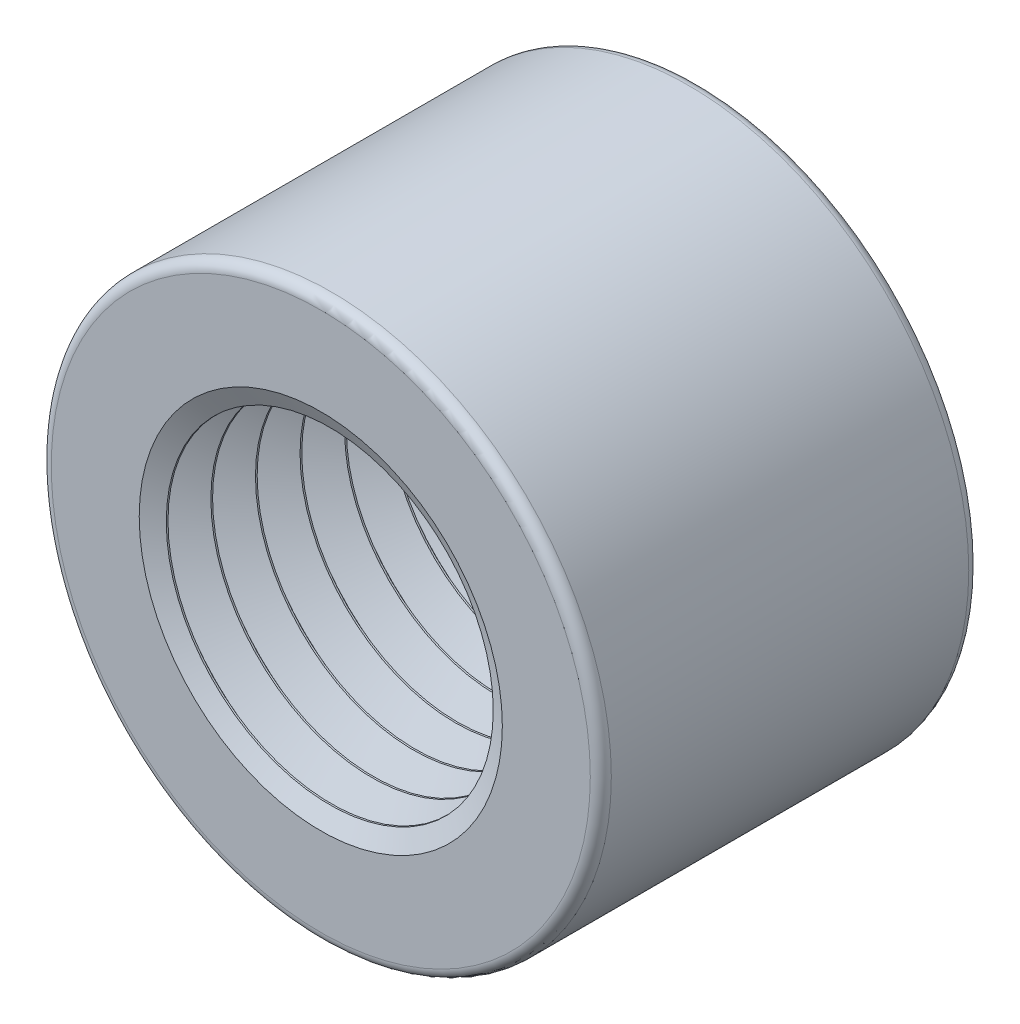
ISO-10303-21;
HEADER;
FILE_DESCRIPTION(('STEP AP214'),'2;1');
FILE_NAME('part.step','',(''),(''),'','','');
FILE_SCHEMA(('AUTOMOTIVE_DESIGN { 1 0 10303 214 1 1 1 1 }'));
ENDSEC;
DATA;
#1=APPLICATION_CONTEXT('core data for automotive mechanical design processes');
#2=APPLICATION_PROTOCOL_DEFINITION('international standard','automotive_design',2000,#1);
#3=PRODUCT_CONTEXT('',#1,'mechanical');
#4=PRODUCT('Part','Part','',(#3));
#5=PRODUCT_RELATED_PRODUCT_CATEGORY('part','',(#4));
#6=PRODUCT_DEFINITION_FORMATION('','',#4);
#7=PRODUCT_DEFINITION_CONTEXT('part definition',#1,'design');
#8=PRODUCT_DEFINITION('design','',#6,#7);
#9=PRODUCT_DEFINITION_SHAPE('','',#8);
#10=(LENGTH_UNIT() NAMED_UNIT(*) SI_UNIT(.MILLI.,.METRE.));
#11=(NAMED_UNIT(*) PLANE_ANGLE_UNIT() SI_UNIT($,.RADIAN.));
#12=(NAMED_UNIT(*) SI_UNIT($,.STERADIAN.) SOLID_ANGLE_UNIT());
#13=UNCERTAINTY_MEASURE_WITH_UNIT(LENGTH_MEASURE(1.E-05),#10,'distance_accuracy_value','');
#14=(GEOMETRIC_REPRESENTATION_CONTEXT(3) GLOBAL_UNCERTAINTY_ASSIGNED_CONTEXT((#13)) GLOBAL_UNIT_ASSIGNED_CONTEXT((#10,
#11,#12)) REPRESENTATION_CONTEXT('',''));
#15=CARTESIAN_POINT('',(0.,0.,0.));
#16=DIRECTION('',(0.,0.,1.));
#17=DIRECTION('',(1.,0.,0.));
#18=AXIS2_PLACEMENT_3D('',#15,#16,#17);
#19=CARTESIAN_POINT('',(0.,0.,6.35));
#20=DIRECTION('',(0.,0.,1.));
#21=DIRECTION('',(1.,0.,0.));
#22=AXIS2_PLACEMENT_3D('',#19,#20,#21);
#23=PLANE('',#22);
#24=CARTESIAN_POINT('',(0.,0.,6.35));
#25=DIRECTION('',(0.,0.,1.));
#26=DIRECTION('',(1.,0.,0.));
#27=AXIS2_PLACEMENT_3D('',#24,#25,#26);
#28=CIRCLE('',#27,6.0930204962207);
#29=CARTESIAN_POINT('',(6.0930204962207,0.,6.35));
#30=VERTEX_POINT('',#29);
#31=EDGE_CURVE('E37',#30,#30,#28,.T.);
#32=ORIENTED_EDGE('',*,*,#31,.F.);
#33=EDGE_LOOP('',(#32));
#34=FACE_BOUND('',#33,.T.);
#35=CARTESIAN_POINT('',(0.,0.,6.35));
#36=DIRECTION('',(0.,0.,1.));
#37=DIRECTION('',(1.,0.,0.));
#38=AXIS2_PLACEMENT_3D('',#35,#36,#37);
#39=CIRCLE('',#38,9.04522222222222);
#40=CARTESIAN_POINT('',(9.04522222222222,0.,6.35));
#41=VERTEX_POINT('',#40);
#42=EDGE_CURVE('E11',#41,#41,#39,.T.);
#43=ORIENTED_EDGE('',*,*,#42,.T.);
#44=EDGE_LOOP('',(#43));
#45=FACE_BOUND('',#44,.T.);
#46=ADVANCED_FACE('F33',(#34,#45),#23,.T.);
#47=CARTESIAN_POINT('',(0.,0.,-6.35));
#48=DIRECTION('',(0.,0.,1.));
#49=DIRECTION('',(1.,0.,0.));
#50=AXIS2_PLACEMENT_3D('',#47,#48,#49);
#51=PLANE('',#50);
#52=CARTESIAN_POINT('',(0.,0.,-6.35));
#53=DIRECTION('',(0.,0.,1.));
#54=DIRECTION('',(1.,0.,0.));
#55=AXIS2_PLACEMENT_3D('',#52,#53,#54);
#56=CIRCLE('',#55,9.04522222222222);
#57=CARTESIAN_POINT('',(9.04522222222222,0.,-6.35));
#58=VERTEX_POINT('',#57);
#59=EDGE_CURVE('E41',#58,#58,#56,.F.);
#60=ORIENTED_EDGE('',*,*,#59,.T.);
#61=EDGE_LOOP('',(#60));
#62=FACE_BOUND('',#61,.T.);
#63=CARTESIAN_POINT('',(0.,0.,-6.35));
#64=DIRECTION('',(0.,0.,1.));
#65=DIRECTION('',(1.,0.,0.));
#66=AXIS2_PLACEMENT_3D('',#63,#64,#65);
#67=CIRCLE('',#66,4.86939938663337);
#68=CARTESIAN_POINT('',(4.86939938663337,0.,-6.35));
#69=VERTEX_POINT('',#68);
#70=EDGE_CURVE('E53',#69,#69,#67,.T.);
#71=ORIENTED_EDGE('',*,*,#70,.T.);
#72=EDGE_LOOP('',(#71));
#73=FACE_BOUND('',#72,.T.);
#74=ADVANCED_FACE('F154',(#62,#73),#51,.F.);
#75=CARTESIAN_POINT('',(0.,0.,6.35));
#76=DIRECTION('',(0.,0.,-1.));
#77=DIRECTION('',(-1.,0.,0.));
#78=AXIS2_PLACEMENT_3D('',#75,#76,#77);
#79=CYLINDRICAL_SURFACE('',#78,9.398);
#80=CARTESIAN_POINT('',(0.,0.,-5.99722222222222));
#81=DIRECTION('',(0.,0.,1.));
#82=DIRECTION('',(1.,0.,0.));
#83=AXIS2_PLACEMENT_3D('',#80,#81,#82);
#84=CIRCLE('',#83,9.398);
#85=CARTESIAN_POINT('',(9.398,0.,-5.99722222222222));
#86=VERTEX_POINT('',#85);
#87=EDGE_CURVE('E45',#86,#86,#84,.T.);
#88=ORIENTED_EDGE('',*,*,#87,.T.);
#89=EDGE_LOOP('',(#88));
#90=FACE_BOUND('',#89,.T.);
#91=CARTESIAN_POINT('',(0.,0.,5.99722222222222));
#92=DIRECTION('',(0.,0.,1.));
#93=DIRECTION('',(1.,0.,0.));
#94=AXIS2_PLACEMENT_3D('',#91,#92,#93);
#95=CIRCLE('',#94,9.398);
#96=CARTESIAN_POINT('',(9.398,0.,5.99722222222222));
#97=VERTEX_POINT('',#96);
#98=EDGE_CURVE('E50',#97,#97,#95,.F.);
#99=ORIENTED_EDGE('',*,*,#98,.T.);
#100=EDGE_LOOP('',(#99));
#101=FACE_BOUND('',#100,.T.);
#102=ADVANCED_FACE('F150',(#90,#101),#79,.T.);
#103=CARTESIAN_POINT('',(0.,0.,0.));
#104=DIRECTION('',(0.,0.,1.));
#105=DIRECTION('',(1.,0.,0.));
#106=AXIS2_PLACEMENT_3D('',#103,#104,#105);
#107=CYLINDRICAL_SURFACE('',#106,4.86939938663337);
#108=CARTESIAN_POINT('',(0.,0.,-3.81000000000002));
#109=DIRECTION('',(0.,0.,-1.));
#110=DIRECTION('',(-1.,0.,0.));
#111=AXIS2_PLACEMENT_3D('',#108,#109,#110);
#112=CIRCLE('',#111,4.86939938663337);
#113=CARTESIAN_POINT('',(-4.86939938663337,0.,-3.81000000000002));
#114=VERTEX_POINT('',#113);
#115=EDGE_CURVE('E140',#114,#114,#112,.T.);
#116=ORIENTED_EDGE('',*,*,#115,.F.);
#117=EDGE_LOOP('',(#116));
#118=FACE_BOUND('',#117,.T.);
#119=ORIENTED_EDGE('',*,*,#70,.F.);
#120=EDGE_LOOP('',(#119));
#121=FACE_BOUND('',#120,.T.);
#122=ADVANCED_FACE('F146',(#118,#121),#107,.F.);
#123=CARTESIAN_POINT('',(0.,0.,-5.99722222222222));
#124=DIRECTION('',(0.,0.,1.));
#125=DIRECTION('',(1.,0.,0.));
#126=AXIS2_PLACEMENT_3D('',#123,#124,#125);
#127=TOROIDAL_SURFACE('',#126,9.04522222222222,0.352777777777778);
#128=ORIENTED_EDGE('',*,*,#59,.F.);
#129=EDGE_LOOP('',(#128));
#130=FACE_BOUND('',#129,.T.);
#131=ORIENTED_EDGE('',*,*,#87,.F.);
#132=EDGE_LOOP('',(#131));
#133=FACE_BOUND('',#132,.T.);
#134=ADVANCED_FACE('F149',(#130,#133),#127,.T.);
#135=CARTESIAN_POINT('',(0.,0.,5.99722222222222));
#136=DIRECTION('',(0.,0.,1.));
#137=DIRECTION('',(1.,0.,0.));
#138=AXIS2_PLACEMENT_3D('',#135,#136,#137);
#139=TOROIDAL_SURFACE('',#138,9.04522222222222,0.352777777777778);
#140=ORIENTED_EDGE('',*,*,#98,.F.);
#141=EDGE_LOOP('',(#140));
#142=FACE_BOUND('',#141,.T.);
#143=ORIENTED_EDGE('',*,*,#42,.F.);
#144=EDGE_LOOP('',(#143));
#145=FACE_BOUND('',#144,.T.);
#146=ADVANCED_FACE('F35',(#142,#145),#139,.T.);
#147=CARTESIAN_POINT('',(0.,0.,6.04850214048261));
#148=DIRECTION('',(0.,0.,1.));
#149=DIRECTION('',(1.,0.,0.));
#150=AXIS2_PLACEMENT_3D('',#147,#148,#149);
#151=CONICAL_SURFACE('',#150,5.4861889563086,1.10968033841801);
#152=ORIENTED_EDGE('',*,*,#31,.T.);
#153=EDGE_LOOP('',(#152));
#154=FACE_BOUND('',#153,.T.);
#155=CARTESIAN_POINT('',(0.,0.,6.04850214048261));
#156=DIRECTION('',(0.,0.,-1.));
#157=DIRECTION('',(-1.,0.,0.));
#158=AXIS2_PLACEMENT_3D('',#155,#156,#157);
#159=CIRCLE('',#158,5.4861889563086);
#160=CARTESIAN_POINT('',(-5.4861889563086,0.,6.04850214048261));
#161=VERTEX_POINT('',#160);
#162=EDGE_CURVE('E56',#161,#161,#159,.T.);
#163=ORIENTED_EDGE('',*,*,#162,.T.);
#164=EDGE_LOOP('',(#163));
#165=FACE_BOUND('',#164,.T.);
#166=ADVANCED_FACE('F171',(#154,#165),#151,.F.);
#167=CARTESIAN_POINT('',(0.,0.,5.9948158578326));
#168=DIRECTION('',(0.,0.,1.));
#169=DIRECTION('',(1.,0.,0.));
#170=AXIS2_PLACEMENT_3D('',#167,#168,#169);
#171=CONICAL_SURFACE('',#170,5.48283011551298,0.0624827872213823);
#172=ORIENTED_EDGE('',*,*,#162,.F.);
#173=EDGE_LOOP('',(#172));
#174=FACE_BOUND('',#173,.T.);
#175=CARTESIAN_POINT('',(0.,0.,5.9948158578326));
#176=DIRECTION('',(0.,0.,-1.));
#177=DIRECTION('',(-1.,0.,0.));
#178=AXIS2_PLACEMENT_3D('',#175,#176,#177);
#179=CIRCLE('',#178,5.48283011551298);
#180=CARTESIAN_POINT('',(-5.48283011551298,0.,5.9948158578326));
#181=VERTEX_POINT('',#180);
#182=EDGE_CURVE('E59',#181,#181,#179,.T.);
#183=ORIENTED_EDGE('',*,*,#182,.T.);
#184=EDGE_LOOP('',(#183));
#185=FACE_BOUND('',#184,.T.);
#186=ADVANCED_FACE('F182',(#174,#185),#171,.F.);
#187=CARTESIAN_POINT('',(0.,0.,5.2738331796281));
#188=DIRECTION('',(0.,0.,-1.));
#189=DIRECTION('',(-1.,0.,0.));
#190=AXIS2_PLACEMENT_3D('',#187,#188,#189);
#191=CONICAL_SURFACE('',#190,6.56881851738696,0.984714763975207);
#192=ORIENTED_EDGE('',*,*,#182,.F.);
#193=EDGE_LOOP('',(#192));
#194=FACE_BOUND('',#193,.T.);
#195=CARTESIAN_POINT('',(0.,0.,5.2738331796281));
#196=DIRECTION('',(0.,0.,-1.));
#197=DIRECTION('',(-1.,0.,0.));
#198=AXIS2_PLACEMENT_3D('',#195,#196,#197);
#199=CIRCLE('',#198,6.56881851738696);
#200=CARTESIAN_POINT('',(-6.56881851738696,0.,5.2738331796281));
#201=VERTEX_POINT('',#200);
#202=EDGE_CURVE('E62',#201,#201,#199,.T.);
#203=ORIENTED_EDGE('',*,*,#202,.T.);
#204=EDGE_LOOP('',(#203));
#205=FACE_BOUND('',#204,.T.);
#206=ADVANCED_FACE('F188',(#194,#205),#191,.F.);
#207=CARTESIAN_POINT('',(0.,0.,5.22014689697808));
#208=DIRECTION('',(0.,0.,1.));
#209=DIRECTION('',(1.,0.,0.));
#210=AXIS2_PLACEMENT_3D('',#207,#208,#209);
#211=CONICAL_SURFACE('',#210,6.56545967659134,0.0624827872213823);
#212=ORIENTED_EDGE('',*,*,#202,.F.);
#213=EDGE_LOOP('',(#212));
#214=FACE_BOUND('',#213,.T.);
#215=CARTESIAN_POINT('',(0.,0.,5.22014689697808));
#216=DIRECTION('',(0.,0.,-1.));
#217=DIRECTION('',(-1.,0.,0.));
#218=AXIS2_PLACEMENT_3D('',#215,#216,#217);
#219=CIRCLE('',#218,6.56545967659134);
#220=CARTESIAN_POINT('',(-6.56545967659134,0.,5.22014689697808));
#221=VERTEX_POINT('',#220);
#222=EDGE_CURVE('E65',#221,#221,#219,.T.);
#223=ORIENTED_EDGE('',*,*,#222,.T.);
#224=EDGE_LOOP('',(#223));
#225=FACE_BOUND('',#224,.T.);
#226=ADVANCED_FACE('F196',(#214,#225),#211,.F.);
#227=CARTESIAN_POINT('',(0.,0.,4.64014469184224));
#228=DIRECTION('',(0.,0.,1.));
#229=DIRECTION('',(1.,0.,0.));
#230=AXIS2_PLACEMENT_3D('',#227,#228,#229);
#231=CONICAL_SURFACE('',#230,5.39807616064071,1.10968033841801);
#232=ORIENTED_EDGE('',*,*,#222,.F.);
#233=EDGE_LOOP('',(#232));
#234=FACE_BOUND('',#233,.T.);
#235=CARTESIAN_POINT('',(0.,0.,4.64014469184224));
#236=DIRECTION('',(0.,0.,-1.));
#237=DIRECTION('',(-1.,0.,0.));
#238=AXIS2_PLACEMENT_3D('',#235,#236,#237);
#239=CIRCLE('',#238,5.39807616064071);
#240=CARTESIAN_POINT('',(-5.39807616064071,0.,4.64014469184224));
#241=VERTEX_POINT('',#240);
#242=EDGE_CURVE('E68',#241,#241,#239,.T.);
#243=ORIENTED_EDGE('',*,*,#242,.T.);
#244=EDGE_LOOP('',(#243));
#245=FACE_BOUND('',#244,.T.);
#246=ADVANCED_FACE('F200',(#234,#245),#231,.F.);
#247=CARTESIAN_POINT('',(0.,0.,4.58645840919222));
#248=DIRECTION('',(0.,0.,1.));
#249=DIRECTION('',(1.,0.,0.));
#250=AXIS2_PLACEMENT_3D('',#247,#248,#249);
#251=CONICAL_SURFACE('',#250,5.39471731984509,0.0624827872213823);
#252=ORIENTED_EDGE('',*,*,#242,.F.);
#253=EDGE_LOOP('',(#252));
#254=FACE_BOUND('',#253,.T.);
#255=CARTESIAN_POINT('',(0.,0.,4.58645840919222));
#256=DIRECTION('',(0.,0.,-1.));
#257=DIRECTION('',(-1.,0.,0.));
#258=AXIS2_PLACEMENT_3D('',#255,#256,#257);
#259=CIRCLE('',#258,5.39471731984509);
#260=CARTESIAN_POINT('',(-5.39471731984509,0.,4.58645840919222));
#261=VERTEX_POINT('',#260);
#262=EDGE_CURVE('E71',#261,#261,#259,.T.);
#263=ORIENTED_EDGE('',*,*,#262,.T.);
#264=EDGE_LOOP('',(#263));
#265=FACE_BOUND('',#264,.T.);
#266=ADVANCED_FACE('F204',(#254,#265),#251,.F.);
#267=CARTESIAN_POINT('',(0.,0.,3.86547573098772));
#268=DIRECTION('',(0.,0.,-1.));
#269=DIRECTION('',(-1.,0.,0.));
#270=AXIS2_PLACEMENT_3D('',#267,#268,#269);
#271=CONICAL_SURFACE('',#270,6.48070572171907,0.984714763975207);
#272=ORIENTED_EDGE('',*,*,#262,.F.);
#273=EDGE_LOOP('',(#272));
#274=FACE_BOUND('',#273,.T.);
#275=CARTESIAN_POINT('',(0.,0.,3.86547573098772));
#276=DIRECTION('',(0.,0.,-1.));
#277=DIRECTION('',(-1.,0.,0.));
#278=AXIS2_PLACEMENT_3D('',#275,#276,#277);
#279=CIRCLE('',#278,6.48070572171907);
#280=CARTESIAN_POINT('',(-6.48070572171907,0.,3.86547573098772));
#281=VERTEX_POINT('',#280);
#282=EDGE_CURVE('E74',#281,#281,#279,.T.);
#283=ORIENTED_EDGE('',*,*,#282,.T.);
#284=EDGE_LOOP('',(#283));
#285=FACE_BOUND('',#284,.T.);
#286=ADVANCED_FACE('F208',(#274,#285),#271,.F.);
#287=CARTESIAN_POINT('',(0.,0.,3.81178944833771));
#288=DIRECTION('',(0.,0.,1.));
#289=DIRECTION('',(1.,0.,0.));
#290=AXIS2_PLACEMENT_3D('',#287,#288,#289);
#291=CONICAL_SURFACE('',#290,6.47734688092345,0.0624827872213823);
#292=ORIENTED_EDGE('',*,*,#282,.F.);
#293=EDGE_LOOP('',(#292));
#294=FACE_BOUND('',#293,.T.);
#295=CARTESIAN_POINT('',(0.,0.,3.81178944833771));
#296=DIRECTION('',(0.,0.,-1.));
#297=DIRECTION('',(-1.,0.,0.));
#298=AXIS2_PLACEMENT_3D('',#295,#296,#297);
#299=CIRCLE('',#298,6.47734688092345);
#300=CARTESIAN_POINT('',(-6.47734688092345,0.,3.81178944833771));
#301=VERTEX_POINT('',#300);
#302=EDGE_CURVE('E77',#301,#301,#299,.T.);
#303=ORIENTED_EDGE('',*,*,#302,.T.);
#304=EDGE_LOOP('',(#303));
#305=FACE_BOUND('',#304,.T.);
#306=ADVANCED_FACE('F212',(#294,#305),#291,.F.);
#307=CARTESIAN_POINT('',(0.,0.,3.23178724320186));
#308=DIRECTION('',(0.,0.,1.));
#309=DIRECTION('',(1.,0.,0.));
#310=AXIS2_PLACEMENT_3D('',#307,#308,#309);
#311=CONICAL_SURFACE('',#310,5.30996336497282,1.10968033841801);
#312=ORIENTED_EDGE('',*,*,#302,.F.);
#313=EDGE_LOOP('',(#312));
#314=FACE_BOUND('',#313,.T.);
#315=CARTESIAN_POINT('',(0.,0.,3.23178724320186));
#316=DIRECTION('',(0.,0.,-1.));
#317=DIRECTION('',(-1.,0.,0.));
#318=AXIS2_PLACEMENT_3D('',#315,#316,#317);
#319=CIRCLE('',#318,5.30996336497282);
#320=CARTESIAN_POINT('',(-5.30996336497282,0.,3.23178724320186));
#321=VERTEX_POINT('',#320);
#322=EDGE_CURVE('E80',#321,#321,#319,.T.);
#323=ORIENTED_EDGE('',*,*,#322,.T.);
#324=EDGE_LOOP('',(#323));
#325=FACE_BOUND('',#324,.T.);
#326=ADVANCED_FACE('F216',(#314,#325),#311,.F.);
#327=CARTESIAN_POINT('',(0.,0.,3.17810096055185));
#328=DIRECTION('',(0.,0.,1.));
#329=DIRECTION('',(1.,0.,0.));
#330=AXIS2_PLACEMENT_3D('',#327,#328,#329);
#331=CONICAL_SURFACE('',#330,5.3066045241772,0.0624827872213823);
#332=ORIENTED_EDGE('',*,*,#322,.F.);
#333=EDGE_LOOP('',(#332));
#334=FACE_BOUND('',#333,.T.);
#335=CARTESIAN_POINT('',(0.,0.,3.17810096055185));
#336=DIRECTION('',(0.,0.,-1.));
#337=DIRECTION('',(-1.,0.,0.));
#338=AXIS2_PLACEMENT_3D('',#335,#336,#337);
#339=CIRCLE('',#338,5.3066045241772);
#340=CARTESIAN_POINT('',(-5.3066045241772,0.,3.17810096055185));
#341=VERTEX_POINT('',#340);
#342=EDGE_CURVE('E83',#341,#341,#339,.T.);
#343=ORIENTED_EDGE('',*,*,#342,.T.);
#344=EDGE_LOOP('',(#343));
#345=FACE_BOUND('',#344,.T.);
#346=ADVANCED_FACE('F220',(#334,#345),#331,.F.);
#347=CARTESIAN_POINT('',(0.,0.,2.45711828234735));
#348=DIRECTION('',(0.,0.,-1.));
#349=DIRECTION('',(-1.,0.,0.));
#350=AXIS2_PLACEMENT_3D('',#347,#348,#349);
#351=CONICAL_SURFACE('',#350,6.39259292605118,0.984714763975207);
#352=ORIENTED_EDGE('',*,*,#342,.F.);
#353=EDGE_LOOP('',(#352));
#354=FACE_BOUND('',#353,.T.);
#355=CARTESIAN_POINT('',(0.,0.,2.45711828234735));
#356=DIRECTION('',(0.,0.,-1.));
#357=DIRECTION('',(-1.,0.,0.));
#358=AXIS2_PLACEMENT_3D('',#355,#356,#357);
#359=CIRCLE('',#358,6.39259292605118);
#360=CARTESIAN_POINT('',(-6.39259292605118,0.,2.45711828234735));
#361=VERTEX_POINT('',#360);
#362=EDGE_CURVE('E86',#361,#361,#359,.T.);
#363=ORIENTED_EDGE('',*,*,#362,.T.);
#364=EDGE_LOOP('',(#363));
#365=FACE_BOUND('',#364,.T.);
#366=ADVANCED_FACE('F224',(#354,#365),#351,.F.);
#367=CARTESIAN_POINT('',(0.,0.,2.40343199969734));
#368=DIRECTION('',(0.,0.,1.));
#369=DIRECTION('',(1.,0.,0.));
#370=AXIS2_PLACEMENT_3D('',#367,#368,#369);
#371=CONICAL_SURFACE('',#370,6.38923408525556,0.0624827872213823);
#372=ORIENTED_EDGE('',*,*,#362,.F.);
#373=EDGE_LOOP('',(#372));
#374=FACE_BOUND('',#373,.T.);
#375=CARTESIAN_POINT('',(0.,0.,2.40343199969734));
#376=DIRECTION('',(0.,0.,-1.));
#377=DIRECTION('',(-1.,0.,0.));
#378=AXIS2_PLACEMENT_3D('',#375,#376,#377);
#379=CIRCLE('',#378,6.38923408525556);
#380=CARTESIAN_POINT('',(-6.38923408525556,0.,2.40343199969734));
#381=VERTEX_POINT('',#380);
#382=EDGE_CURVE('E89',#381,#381,#379,.T.);
#383=ORIENTED_EDGE('',*,*,#382,.T.);
#384=EDGE_LOOP('',(#383));
#385=FACE_BOUND('',#384,.T.);
#386=ADVANCED_FACE('F228',(#374,#385),#371,.F.);
#387=CARTESIAN_POINT('',(0.,0.,1.82342979456147));
#388=DIRECTION('',(0.,0.,1.));
#389=DIRECTION('',(1.,0.,0.));
#390=AXIS2_PLACEMENT_3D('',#387,#388,#389);
#391=CONICAL_SURFACE('',#390,5.22185056930493,1.109680338418);
#392=ORIENTED_EDGE('',*,*,#382,.F.);
#393=EDGE_LOOP('',(#392));
#394=FACE_BOUND('',#393,.T.);
#395=CARTESIAN_POINT('',(0.,0.,1.82342979456147));
#396=DIRECTION('',(0.,0.,-1.));
#397=DIRECTION('',(-1.,0.,0.));
#398=AXIS2_PLACEMENT_3D('',#395,#396,#397);
#399=CIRCLE('',#398,5.22185056930493);
#400=CARTESIAN_POINT('',(-5.22185056930493,0.,1.82342979456147));
#401=VERTEX_POINT('',#400);
#402=EDGE_CURVE('E92',#401,#401,#399,.T.);
#403=ORIENTED_EDGE('',*,*,#402,.T.);
#404=EDGE_LOOP('',(#403));
#405=FACE_BOUND('',#404,.T.);
#406=ADVANCED_FACE('F232',(#394,#405),#391,.F.);
#407=CARTESIAN_POINT('',(0.,0.,1.76974351191146));
#408=DIRECTION('',(0.,0.,1.));
#409=DIRECTION('',(1.,0.,0.));
#410=AXIS2_PLACEMENT_3D('',#407,#408,#409);
#411=CONICAL_SURFACE('',#410,5.21849172850931,0.0624827872213823);
#412=ORIENTED_EDGE('',*,*,#402,.F.);
#413=EDGE_LOOP('',(#412));
#414=FACE_BOUND('',#413,.T.);
#415=CARTESIAN_POINT('',(0.,0.,1.76974351191146));
#416=DIRECTION('',(0.,0.,-1.));
#417=DIRECTION('',(-1.,0.,0.));
#418=AXIS2_PLACEMENT_3D('',#415,#416,#417);
#419=CIRCLE('',#418,5.21849172850931);
#420=CARTESIAN_POINT('',(-5.21849172850931,0.,1.76974351191146));
#421=VERTEX_POINT('',#420);
#422=EDGE_CURVE('E95',#421,#421,#419,.T.);
#423=ORIENTED_EDGE('',*,*,#422,.T.);
#424=EDGE_LOOP('',(#423));
#425=FACE_BOUND('',#424,.T.);
#426=ADVANCED_FACE('F236',(#414,#425),#411,.F.);
#427=CARTESIAN_POINT('',(0.,0.,1.04876083370697));
#428=DIRECTION('',(0.,0.,-1.));
#429=DIRECTION('',(-1.,0.,0.));
#430=AXIS2_PLACEMENT_3D('',#427,#428,#429);
#431=CONICAL_SURFACE('',#430,6.30448013038329,0.984714763975216);
#432=ORIENTED_EDGE('',*,*,#422,.F.);
#433=EDGE_LOOP('',(#432));
#434=FACE_BOUND('',#433,.T.);
#435=CARTESIAN_POINT('',(0.,0.,1.04876083370697));
#436=DIRECTION('',(0.,0.,-1.));
#437=DIRECTION('',(-1.,0.,0.));
#438=AXIS2_PLACEMENT_3D('',#435,#436,#437);
#439=CIRCLE('',#438,6.30448013038329);
#440=CARTESIAN_POINT('',(-6.30448013038329,0.,1.04876083370697));
#441=VERTEX_POINT('',#440);
#442=EDGE_CURVE('E98',#441,#441,#439,.T.);
#443=ORIENTED_EDGE('',*,*,#442,.T.);
#444=EDGE_LOOP('',(#443));
#445=FACE_BOUND('',#444,.T.);
#446=ADVANCED_FACE('F240',(#434,#445),#431,.F.);
#447=CARTESIAN_POINT('',(0.,0.,0.995074551056963));
#448=DIRECTION('',(0.,0.,1.));
#449=DIRECTION('',(1.,0.,0.));
#450=AXIS2_PLACEMENT_3D('',#447,#448,#449);
#451=CONICAL_SURFACE('',#450,6.30112128958767,0.0624827872213823);
#452=ORIENTED_EDGE('',*,*,#442,.F.);
#453=EDGE_LOOP('',(#452));
#454=FACE_BOUND('',#453,.T.);
#455=CARTESIAN_POINT('',(0.,0.,0.995074551056963));
#456=DIRECTION('',(0.,0.,-1.));
#457=DIRECTION('',(-1.,0.,0.));
#458=AXIS2_PLACEMENT_3D('',#455,#456,#457);
#459=CIRCLE('',#458,6.30112128958767);
#460=CARTESIAN_POINT('',(-6.30112128958767,0.,0.995074551056963));
#461=VERTEX_POINT('',#460);
#462=EDGE_CURVE('E101',#461,#461,#459,.T.);
#463=ORIENTED_EDGE('',*,*,#462,.T.);
#464=EDGE_LOOP('',(#463));
#465=FACE_BOUND('',#464,.T.);
#466=ADVANCED_FACE('F244',(#454,#465),#451,.F.);
#467=CARTESIAN_POINT('',(0.,0.,0.4150723459211));
#468=DIRECTION('',(0.,0.,1.));
#469=DIRECTION('',(1.,0.,0.));
#470=AXIS2_PLACEMENT_3D('',#467,#468,#469);
#471=CONICAL_SURFACE('',#470,5.13373777363704,1.109680338418);
#472=ORIENTED_EDGE('',*,*,#462,.F.);
#473=EDGE_LOOP('',(#472));
#474=FACE_BOUND('',#473,.T.);
#475=CARTESIAN_POINT('',(0.,0.,0.4150723459211));
#476=DIRECTION('',(0.,0.,-1.));
#477=DIRECTION('',(-1.,0.,0.));
#478=AXIS2_PLACEMENT_3D('',#475,#476,#477);
#479=CIRCLE('',#478,5.13373777363704);
#480=CARTESIAN_POINT('',(-5.13373777363704,0.,0.4150723459211));
#481=VERTEX_POINT('',#480);
#482=EDGE_CURVE('E104',#481,#481,#479,.T.);
#483=ORIENTED_EDGE('',*,*,#482,.T.);
#484=EDGE_LOOP('',(#483));
#485=FACE_BOUND('',#484,.T.);
#486=ADVANCED_FACE('F248',(#474,#485),#471,.F.);
#487=CARTESIAN_POINT('',(0.,0.,0.361386063271088));
#488=DIRECTION('',(0.,0.,1.));
#489=DIRECTION('',(1.,0.,0.));
#490=AXIS2_PLACEMENT_3D('',#487,#488,#489);
#491=CONICAL_SURFACE('',#490,5.13037893284142,0.0624827872213823);
#492=ORIENTED_EDGE('',*,*,#482,.F.);
#493=EDGE_LOOP('',(#492));
#494=FACE_BOUND('',#493,.T.);
#495=CARTESIAN_POINT('',(0.,0.,0.361386063271088));
#496=DIRECTION('',(0.,0.,-1.));
#497=DIRECTION('',(-1.,0.,0.));
#498=AXIS2_PLACEMENT_3D('',#495,#496,#497);
#499=CIRCLE('',#498,5.13037893284142);
#500=CARTESIAN_POINT('',(-5.13037893284142,0.,0.361386063271088));
#501=VERTEX_POINT('',#500);
#502=EDGE_CURVE('E107',#501,#501,#499,.T.);
#503=ORIENTED_EDGE('',*,*,#502,.T.);
#504=EDGE_LOOP('',(#503));
#505=FACE_BOUND('',#504,.T.);
#506=ADVANCED_FACE('F252',(#494,#505),#491,.F.);
#507=CARTESIAN_POINT('',(0.,0.,-0.3595966149334));
#508=DIRECTION('',(0.,0.,-1.));
#509=DIRECTION('',(-1.,0.,0.));
#510=AXIS2_PLACEMENT_3D('',#507,#508,#509);
#511=CONICAL_SURFACE('',#510,6.2163673347154,0.984714763975216);
#512=ORIENTED_EDGE('',*,*,#502,.F.);
#513=EDGE_LOOP('',(#512));
#514=FACE_BOUND('',#513,.T.);
#515=CARTESIAN_POINT('',(0.,0.,-0.3595966149334));
#516=DIRECTION('',(0.,0.,-1.));
#517=DIRECTION('',(-1.,0.,0.));
#518=AXIS2_PLACEMENT_3D('',#515,#516,#517);
#519=CIRCLE('',#518,6.2163673347154);
#520=CARTESIAN_POINT('',(-6.2163673347154,0.,-0.3595966149334));
#521=VERTEX_POINT('',#520);
#522=EDGE_CURVE('E110',#521,#521,#519,.T.);
#523=ORIENTED_EDGE('',*,*,#522,.T.);
#524=EDGE_LOOP('',(#523));
#525=FACE_BOUND('',#524,.T.);
#526=ADVANCED_FACE('F256',(#514,#525),#511,.F.);
#527=CARTESIAN_POINT('',(0.,0.,-0.413282897583411));
#528=DIRECTION('',(0.,0.,1.));
#529=DIRECTION('',(1.,0.,0.));
#530=AXIS2_PLACEMENT_3D('',#527,#528,#529);
#531=CONICAL_SURFACE('',#530,6.21300849391978,0.0624827872213823);
#532=ORIENTED_EDGE('',*,*,#522,.F.);
#533=EDGE_LOOP('',(#532));
#534=FACE_BOUND('',#533,.T.);
#535=CARTESIAN_POINT('',(0.,0.,-0.413282897583411));
#536=DIRECTION('',(0.,0.,-1.));
#537=DIRECTION('',(-1.,0.,0.));
#538=AXIS2_PLACEMENT_3D('',#535,#536,#537);
#539=CIRCLE('',#538,6.21300849391978);
#540=CARTESIAN_POINT('',(-6.21300849391978,0.,-0.413282897583411));
#541=VERTEX_POINT('',#540);
#542=EDGE_CURVE('E113',#541,#541,#539,.T.);
#543=ORIENTED_EDGE('',*,*,#542,.T.);
#544=EDGE_LOOP('',(#543));
#545=FACE_BOUND('',#544,.T.);
#546=ADVANCED_FACE('F260',(#534,#545),#531,.F.);
#547=CARTESIAN_POINT('',(0.,0.,-0.993285102719274));
#548=DIRECTION('',(0.,0.,1.));
#549=DIRECTION('',(1.,0.,0.));
#550=AXIS2_PLACEMENT_3D('',#547,#548,#549);
#551=CONICAL_SURFACE('',#550,5.04562497796915,1.109680338418);
#552=ORIENTED_EDGE('',*,*,#542,.F.);
#553=EDGE_LOOP('',(#552));
#554=FACE_BOUND('',#553,.T.);
#555=CARTESIAN_POINT('',(0.,0.,-0.993285102719274));
#556=DIRECTION('',(0.,0.,-1.));
#557=DIRECTION('',(-1.,0.,0.));
#558=AXIS2_PLACEMENT_3D('',#555,#556,#557);
#559=CIRCLE('',#558,5.04562497796915);
#560=CARTESIAN_POINT('',(-5.04562497796915,0.,-0.993285102719274));
#561=VERTEX_POINT('',#560);
#562=EDGE_CURVE('E116',#561,#561,#559,.T.);
#563=ORIENTED_EDGE('',*,*,#562,.T.);
#564=EDGE_LOOP('',(#563));
#565=FACE_BOUND('',#564,.T.);
#566=ADVANCED_FACE('F264',(#554,#565),#551,.F.);
#567=CARTESIAN_POINT('',(0.,0.,-1.04697138536929));
#568=DIRECTION('',(0.,0.,1.));
#569=DIRECTION('',(1.,0.,0.));
#570=AXIS2_PLACEMENT_3D('',#567,#568,#569);
#571=CONICAL_SURFACE('',#570,5.04226613717353,0.0624827872213823);
#572=ORIENTED_EDGE('',*,*,#562,.F.);
#573=EDGE_LOOP('',(#572));
#574=FACE_BOUND('',#573,.T.);
#575=CARTESIAN_POINT('',(0.,0.,-1.04697138536929));
#576=DIRECTION('',(0.,0.,-1.));
#577=DIRECTION('',(-1.,0.,0.));
#578=AXIS2_PLACEMENT_3D('',#575,#576,#577);
#579=CIRCLE('',#578,5.04226613717353);
#580=CARTESIAN_POINT('',(-5.04226613717353,0.,-1.04697138536929));
#581=VERTEX_POINT('',#580);
#582=EDGE_CURVE('E119',#581,#581,#579,.T.);
#583=ORIENTED_EDGE('',*,*,#582,.T.);
#584=EDGE_LOOP('',(#583));
#585=FACE_BOUND('',#584,.T.);
#586=ADVANCED_FACE('F268',(#574,#585),#571,.F.);
#587=CARTESIAN_POINT('',(0.,0.,-1.76795406357377));
#588=DIRECTION('',(0.,0.,-1.));
#589=DIRECTION('',(-1.,0.,0.));
#590=AXIS2_PLACEMENT_3D('',#587,#588,#589);
#591=CONICAL_SURFACE('',#590,6.12825453904751,0.984714763975216);
#592=ORIENTED_EDGE('',*,*,#582,.F.);
#593=EDGE_LOOP('',(#592));
#594=FACE_BOUND('',#593,.T.);
#595=CARTESIAN_POINT('',(0.,0.,-1.76795406357377));
#596=DIRECTION('',(0.,0.,-1.));
#597=DIRECTION('',(-1.,0.,0.));
#598=AXIS2_PLACEMENT_3D('',#595,#596,#597);
#599=CIRCLE('',#598,6.12825453904751);
#600=CARTESIAN_POINT('',(-6.12825453904751,0.,-1.76795406357377));
#601=VERTEX_POINT('',#600);
#602=EDGE_CURVE('E122',#601,#601,#599,.T.);
#603=ORIENTED_EDGE('',*,*,#602,.T.);
#604=EDGE_LOOP('',(#603));
#605=FACE_BOUND('',#604,.T.);
#606=ADVANCED_FACE('F272',(#594,#605),#591,.F.);
#607=CARTESIAN_POINT('',(0.,0.,-1.82164034622379));
#608=DIRECTION('',(0.,0.,1.));
#609=DIRECTION('',(1.,0.,0.));
#610=AXIS2_PLACEMENT_3D('',#607,#608,#609);
#611=CONICAL_SURFACE('',#610,6.12489569825189,0.0624827872213823);
#612=ORIENTED_EDGE('',*,*,#602,.F.);
#613=EDGE_LOOP('',(#612));
#614=FACE_BOUND('',#613,.T.);
#615=CARTESIAN_POINT('',(0.,0.,-1.82164034622379));
#616=DIRECTION('',(0.,0.,-1.));
#617=DIRECTION('',(-1.,0.,0.));
#618=AXIS2_PLACEMENT_3D('',#615,#616,#617);
#619=CIRCLE('',#618,6.12489569825189);
#620=CARTESIAN_POINT('',(-6.12489569825189,0.,-1.82164034622379));
#621=VERTEX_POINT('',#620);
#622=EDGE_CURVE('E125',#621,#621,#619,.T.);
#623=ORIENTED_EDGE('',*,*,#622,.T.);
#624=EDGE_LOOP('',(#623));
#625=FACE_BOUND('',#624,.T.);
#626=ADVANCED_FACE('F276',(#614,#625),#611,.F.);
#627=CARTESIAN_POINT('',(0.,0.,-2.40164255135965));
#628=DIRECTION('',(0.,0.,1.));
#629=DIRECTION('',(1.,0.,0.));
#630=AXIS2_PLACEMENT_3D('',#627,#628,#629);
#631=CONICAL_SURFACE('',#630,4.95751218230126,1.109680338418);
#632=ORIENTED_EDGE('',*,*,#622,.F.);
#633=EDGE_LOOP('',(#632));
#634=FACE_BOUND('',#633,.T.);
#635=CARTESIAN_POINT('',(0.,0.,-2.40164255135965));
#636=DIRECTION('',(0.,0.,-1.));
#637=DIRECTION('',(-1.,0.,0.));
#638=AXIS2_PLACEMENT_3D('',#635,#636,#637);
#639=CIRCLE('',#638,4.95751218230126);
#640=CARTESIAN_POINT('',(-4.95751218230126,0.,-2.40164255135965));
#641=VERTEX_POINT('',#640);
#642=EDGE_CURVE('E128',#641,#641,#639,.T.);
#643=ORIENTED_EDGE('',*,*,#642,.T.);
#644=EDGE_LOOP('',(#643));
#645=FACE_BOUND('',#644,.T.);
#646=ADVANCED_FACE('F280',(#634,#645),#631,.F.);
#647=CARTESIAN_POINT('',(0.,0.,-2.45532883400966));
#648=DIRECTION('',(0.,0.,1.));
#649=DIRECTION('',(1.,0.,0.));
#650=AXIS2_PLACEMENT_3D('',#647,#648,#649);
#651=CONICAL_SURFACE('',#650,4.95415334150564,0.0624827872213823);
#652=ORIENTED_EDGE('',*,*,#642,.F.);
#653=EDGE_LOOP('',(#652));
#654=FACE_BOUND('',#653,.T.);
#655=CARTESIAN_POINT('',(0.,0.,-2.45532883400966));
#656=DIRECTION('',(0.,0.,-1.));
#657=DIRECTION('',(-1.,0.,0.));
#658=AXIS2_PLACEMENT_3D('',#655,#656,#657);
#659=CIRCLE('',#658,4.95415334150564);
#660=CARTESIAN_POINT('',(-4.95415334150564,0.,-2.45532883400966));
#661=VERTEX_POINT('',#660);
#662=EDGE_CURVE('E131',#661,#661,#659,.T.);
#663=ORIENTED_EDGE('',*,*,#662,.T.);
#664=EDGE_LOOP('',(#663));
#665=FACE_BOUND('',#664,.T.);
#666=ADVANCED_FACE('F284',(#654,#665),#651,.F.);
#667=CARTESIAN_POINT('',(0.,0.,-3.17631151221415));
#668=DIRECTION('',(0.,0.,-1.));
#669=DIRECTION('',(-1.,0.,0.));
#670=AXIS2_PLACEMENT_3D('',#667,#668,#669);
#671=CONICAL_SURFACE('',#670,6.04014174337962,0.984714763975216);
#672=ORIENTED_EDGE('',*,*,#662,.F.);
#673=EDGE_LOOP('',(#672));
#674=FACE_BOUND('',#673,.T.);
#675=CARTESIAN_POINT('',(0.,0.,-3.17631151221415));
#676=DIRECTION('',(0.,0.,-1.));
#677=DIRECTION('',(-1.,0.,0.));
#678=AXIS2_PLACEMENT_3D('',#675,#676,#677);
#679=CIRCLE('',#678,6.04014174337962);
#680=CARTESIAN_POINT('',(-6.04014174337962,0.,-3.17631151221415));
#681=VERTEX_POINT('',#680);
#682=EDGE_CURVE('E134',#681,#681,#679,.T.);
#683=ORIENTED_EDGE('',*,*,#682,.T.);
#684=EDGE_LOOP('',(#683));
#685=FACE_BOUND('',#684,.T.);
#686=ADVANCED_FACE('F288',(#674,#685),#671,.F.);
#687=CARTESIAN_POINT('',(0.,0.,-3.22999779486416));
#688=DIRECTION('',(0.,0.,1.));
#689=DIRECTION('',(1.,0.,0.));
#690=AXIS2_PLACEMENT_3D('',#687,#688,#689);
#691=CONICAL_SURFACE('',#690,6.036782902584,0.0624827872213823);
#692=ORIENTED_EDGE('',*,*,#682,.F.);
#693=EDGE_LOOP('',(#692));
#694=FACE_BOUND('',#693,.T.);
#695=CARTESIAN_POINT('',(0.,0.,-3.22999779486416));
#696=DIRECTION('',(0.,0.,-1.));
#697=DIRECTION('',(-1.,0.,0.));
#698=AXIS2_PLACEMENT_3D('',#695,#696,#697);
#699=CIRCLE('',#698,6.036782902584);
#700=CARTESIAN_POINT('',(-6.036782902584,0.,-3.22999779486416));
#701=VERTEX_POINT('',#700);
#702=EDGE_CURVE('E137',#701,#701,#699,.T.);
#703=ORIENTED_EDGE('',*,*,#702,.T.);
#704=EDGE_LOOP('',(#703));
#705=FACE_BOUND('',#704,.T.);
#706=ADVANCED_FACE('F292',(#694,#705),#691,.F.);
#707=CARTESIAN_POINT('',(0.,0.,-3.81000000000002));
#708=DIRECTION('',(0.,0.,1.));
#709=DIRECTION('',(1.,0.,0.));
#710=AXIS2_PLACEMENT_3D('',#707,#708,#709);
#711=CONICAL_SURFACE('',#710,4.86939938663337,1.109680338418);
#712=ORIENTED_EDGE('',*,*,#702,.F.);
#713=EDGE_LOOP('',(#712));
#714=FACE_BOUND('',#713,.T.);
#715=ORIENTED_EDGE('',*,*,#115,.T.);
#716=EDGE_LOOP('',(#715));
#717=FACE_BOUND('',#716,.T.);
#718=ADVANCED_FACE('F144',(#714,#717),#711,.F.);
#719=CLOSED_SHELL('',(#46,#74,#102,#122,#134,#146,#166,#186,#206,#226,#246,#266,#286,#306,#326,
#346,#366,#386,#406,#426,#446,#466,#486,#506,#526,#546,#566,#586,#606,#626,#646,#666,#686,#706,#718));
#720=MANIFOLD_SOLID_BREP('B2',#719);
#721=ADVANCED_BREP_SHAPE_REPRESENTATION('',(#18,#720),#14);
#722=SHAPE_DEFINITION_REPRESENTATION(#9,#721);
ENDSEC;
END-ISO-10303-21;
